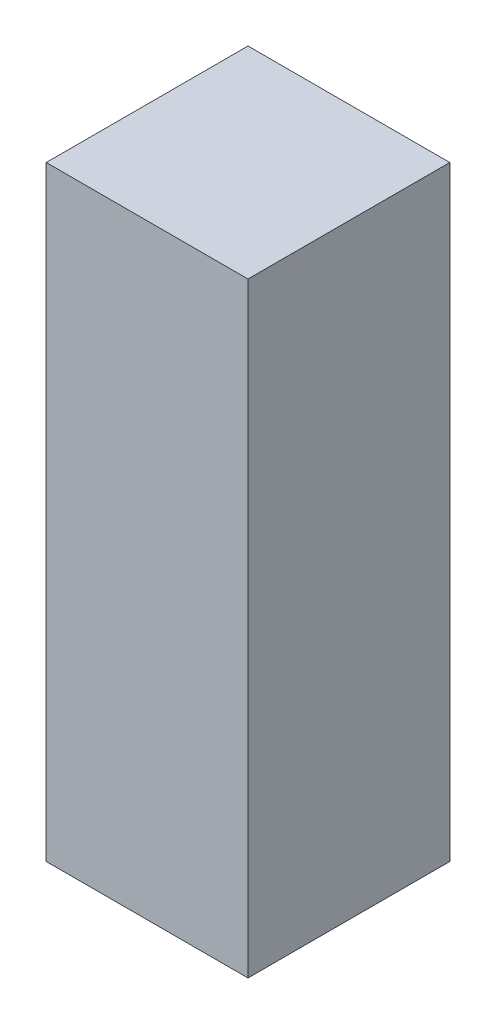
ISO-10303-21;
HEADER;
FILE_DESCRIPTION(('STEP AP214'),'2;1');
FILE_NAME('part.step','',(''),(''),'','','');
FILE_SCHEMA(('AUTOMOTIVE_DESIGN { 1 0 10303 214 1 1 1 1 }'));
ENDSEC;
DATA;
#1=APPLICATION_CONTEXT('core data for automotive mechanical design processes');
#2=APPLICATION_PROTOCOL_DEFINITION('international standard','automotive_design',2000,#1);
#3=PRODUCT_CONTEXT('',#1,'mechanical');
#4=PRODUCT('Part','Part','',(#3));
#5=PRODUCT_RELATED_PRODUCT_CATEGORY('part','',(#4));
#6=PRODUCT_DEFINITION_FORMATION('','',#4);
#7=PRODUCT_DEFINITION_CONTEXT('part definition',#1,'design');
#8=PRODUCT_DEFINITION('design','',#6,#7);
#9=PRODUCT_DEFINITION_SHAPE('','',#8);
#10=(LENGTH_UNIT() NAMED_UNIT(*) SI_UNIT(.MILLI.,.METRE.));
#11=(NAMED_UNIT(*) PLANE_ANGLE_UNIT() SI_UNIT($,.RADIAN.));
#12=(NAMED_UNIT(*) SI_UNIT($,.STERADIAN.) SOLID_ANGLE_UNIT());
#13=UNCERTAINTY_MEASURE_WITH_UNIT(LENGTH_MEASURE(1.E-05),#10,'distance_accuracy_value','');
#14=(GEOMETRIC_REPRESENTATION_CONTEXT(3) GLOBAL_UNCERTAINTY_ASSIGNED_CONTEXT((#13)) GLOBAL_UNIT_ASSIGNED_CONTEXT((#10,
#11,#12)) REPRESENTATION_CONTEXT('',''));
#15=CARTESIAN_POINT('',(0.,0.,0.));
#16=DIRECTION('',(0.,0.,1.));
#17=DIRECTION('',(1.,0.,0.));
#18=AXIS2_PLACEMENT_3D('',#15,#16,#17);
#19=CARTESIAN_POINT('',(5.,-15.,10.));
#20=DIRECTION('',(-1.,0.,0.));
#21=DIRECTION('',(0.,0.,1.));
#22=AXIS2_PLACEMENT_3D('',#19,#20,#21);
#23=PLANE('',#22);
#24=DIRECTION('',(0.,1.,0.));
#25=VECTOR('',#24,1.);
#26=CARTESIAN_POINT('',(5.,-15.,0.));
#27=LINE('',#26,#25);
#28=CARTESIAN_POINT('',(5.,-15.,0.));
#29=VERTEX_POINT('',#28);
#30=CARTESIAN_POINT('',(5.,15.,0.));
#31=VERTEX_POINT('',#30);
#32=EDGE_CURVE('E96',#29,#31,#27,.T.);
#33=ORIENTED_EDGE('',*,*,#32,.T.);
#34=DIRECTION('',(0.,0.,-1.));
#35=VECTOR('',#34,1.);
#36=CARTESIAN_POINT('',(5.,15.,10.));
#37=LINE('',#36,#35);
#38=CARTESIAN_POINT('',(5.,15.,10.));
#39=VERTEX_POINT('',#38);
#40=EDGE_CURVE('E11',#39,#31,#37,.T.);
#41=ORIENTED_EDGE('',*,*,#40,.F.);
#42=DIRECTION('',(0.,1.,0.));
#43=VECTOR('',#42,1.);
#44=CARTESIAN_POINT('',(5.,-15.,10.));
#45=LINE('',#44,#43);
#46=CARTESIAN_POINT('',(5.,-15.,10.));
#47=VERTEX_POINT('',#46);
#48=EDGE_CURVE('E84',#47,#39,#45,.T.);
#49=ORIENTED_EDGE('',*,*,#48,.F.);
#50=DIRECTION('',(0.,0.,-1.));
#51=VECTOR('',#50,1.);
#52=CARTESIAN_POINT('',(5.,-15.,10.));
#53=LINE('',#52,#51);
#54=EDGE_CURVE('E92',#47,#29,#53,.T.);
#55=ORIENTED_EDGE('',*,*,#54,.T.);
#56=EDGE_LOOP('',(#33,#41,#49,#55));
#57=FACE_BOUND('',#56,.T.);
#58=ADVANCED_FACE('F33',(#57),#23,.F.);
#59=CARTESIAN_POINT('',(-5.,15.,10.));
#60=DIRECTION('',(0.,-1.,0.));
#61=DIRECTION('',(0.,0.,-1.));
#62=AXIS2_PLACEMENT_3D('',#59,#60,#61);
#63=PLANE('',#62);
#64=DIRECTION('',(-1.,0.,0.));
#65=VECTOR('',#64,1.);
#66=CARTESIAN_POINT('',(-5.,15.,0.));
#67=LINE('',#66,#65);
#68=CARTESIAN_POINT('',(-5.,15.,0.));
#69=VERTEX_POINT('',#68);
#70=EDGE_CURVE('E88',#31,#69,#67,.T.);
#71=ORIENTED_EDGE('',*,*,#70,.T.);
#72=DIRECTION('',(0.,0.,-1.));
#73=VECTOR('',#72,1.);
#74=CARTESIAN_POINT('',(-5.,15.,10.));
#75=LINE('',#74,#73);
#76=CARTESIAN_POINT('',(-5.,15.,10.));
#77=VERTEX_POINT('',#76);
#78=EDGE_CURVE('E41',#77,#69,#75,.T.);
#79=ORIENTED_EDGE('',*,*,#78,.F.);
#80=DIRECTION('',(-1.,0.,0.));
#81=VECTOR('',#80,1.);
#82=CARTESIAN_POINT('',(-5.,15.,10.));
#83=LINE('',#82,#81);
#84=EDGE_CURVE('E79',#39,#77,#83,.T.);
#85=ORIENTED_EDGE('',*,*,#84,.F.);
#86=ORIENTED_EDGE('',*,*,#40,.T.);
#87=EDGE_LOOP('',(#71,#79,#85,#86));
#88=FACE_BOUND('',#87,.T.);
#89=ADVANCED_FACE('F87',(#88),#63,.F.);
#90=CARTESIAN_POINT('',(-5.,-15.,10.));
#91=DIRECTION('',(1.,0.,0.));
#92=DIRECTION('',(0.,0.,-1.));
#93=AXIS2_PLACEMENT_3D('',#90,#91,#92);
#94=PLANE('',#93);
#95=DIRECTION('',(0.,-1.,0.));
#96=VECTOR('',#95,1.);
#97=CARTESIAN_POINT('',(-5.,-15.,0.));
#98=LINE('',#97,#96);
#99=CARTESIAN_POINT('',(-5.,-15.,0.));
#100=VERTEX_POINT('',#99);
#101=EDGE_CURVE('E66',#69,#100,#98,.T.);
#102=ORIENTED_EDGE('',*,*,#101,.T.);
#103=DIRECTION('',(0.,0.,-1.));
#104=VECTOR('',#103,1.);
#105=CARTESIAN_POINT('',(-5.,-15.,10.));
#106=LINE('',#105,#104);
#107=CARTESIAN_POINT('',(-5.,-15.,10.));
#108=VERTEX_POINT('',#107);
#109=EDGE_CURVE('E89',#108,#100,#106,.T.);
#110=ORIENTED_EDGE('',*,*,#109,.F.);
#111=DIRECTION('',(0.,-1.,0.));
#112=VECTOR('',#111,1.);
#113=CARTESIAN_POINT('',(-5.,-15.,10.));
#114=LINE('',#113,#112);
#115=EDGE_CURVE('E82',#77,#108,#114,.T.);
#116=ORIENTED_EDGE('',*,*,#115,.F.);
#117=ORIENTED_EDGE('',*,*,#78,.T.);
#118=EDGE_LOOP('',(#102,#110,#116,#117));
#119=FACE_BOUND('',#118,.T.);
#120=ADVANCED_FACE('F90',(#119),#94,.F.);
#121=CARTESIAN_POINT('',(-5.,-15.,10.));
#122=DIRECTION('',(0.,1.,0.));
#123=DIRECTION('',(0.,0.,1.));
#124=AXIS2_PLACEMENT_3D('',#121,#122,#123);
#125=PLANE('',#124);
#126=DIRECTION('',(1.,0.,0.));
#127=VECTOR('',#126,1.);
#128=CARTESIAN_POINT('',(-5.,-15.,0.));
#129=LINE('',#128,#127);
#130=EDGE_CURVE('E72',#100,#29,#129,.T.);
#131=ORIENTED_EDGE('',*,*,#130,.T.);
#132=ORIENTED_EDGE('',*,*,#54,.F.);
#133=DIRECTION('',(1.,0.,0.));
#134=VECTOR('',#133,1.);
#135=CARTESIAN_POINT('',(-5.,-15.,10.));
#136=LINE('',#135,#134);
#137=EDGE_CURVE('E49',#108,#47,#136,.T.);
#138=ORIENTED_EDGE('',*,*,#137,.F.);
#139=ORIENTED_EDGE('',*,*,#109,.T.);
#140=EDGE_LOOP('',(#131,#132,#138,#139));
#141=FACE_BOUND('',#140,.T.);
#142=ADVANCED_FACE('F103',(#141),#125,.F.);
#143=CARTESIAN_POINT('',(0.,0.,10.));
#144=DIRECTION('',(0.,0.,-1.));
#145=DIRECTION('',(-1.,0.,0.));
#146=AXIS2_PLACEMENT_3D('',#143,#144,#145);
#147=PLANE('',#146);
#148=ORIENTED_EDGE('',*,*,#48,.T.);
#149=ORIENTED_EDGE('',*,*,#84,.T.);
#150=ORIENTED_EDGE('',*,*,#115,.T.);
#151=ORIENTED_EDGE('',*,*,#137,.T.);
#152=EDGE_LOOP('',(#148,#149,#150,#151));
#153=FACE_BOUND('',#152,.T.);
#154=ADVANCED_FACE('F80',(#153),#147,.F.);
#155=CARTESIAN_POINT('',(0.,0.,0.));
#156=DIRECTION('',(0.,0.,-1.));
#157=DIRECTION('',(-1.,0.,0.));
#158=AXIS2_PLACEMENT_3D('',#155,#156,#157);
#159=PLANE('',#158);
#160=ORIENTED_EDGE('',*,*,#32,.F.);
#161=ORIENTED_EDGE('',*,*,#130,.F.);
#162=ORIENTED_EDGE('',*,*,#101,.F.);
#163=ORIENTED_EDGE('',*,*,#70,.F.);
#164=EDGE_LOOP('',(#160,#161,#162,#163));
#165=FACE_BOUND('',#164,.T.);
#166=ADVANCED_FACE('F106',(#165),#159,.T.);
#167=CLOSED_SHELL('',(#58,#89,#120,#142,#154,#166));
#168=MANIFOLD_SOLID_BREP('B2',#167);
#169=ADVANCED_BREP_SHAPE_REPRESENTATION('',(#18,#168),#14);
#170=SHAPE_DEFINITION_REPRESENTATION(#9,#169);
ENDSEC;
END-ISO-10303-21;
